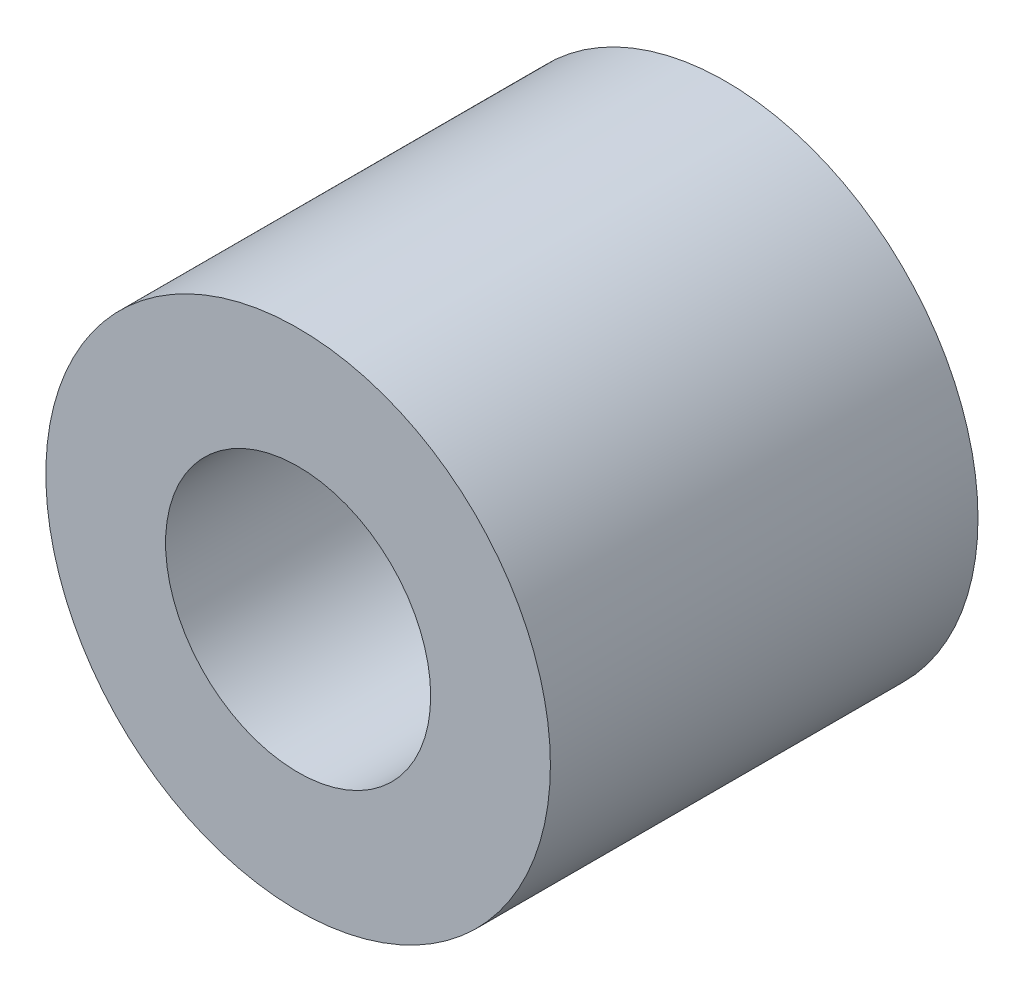
ISO-10303-21;
HEADER;
FILE_DESCRIPTION(('STEP AP214'),'2;1');
FILE_NAME('part.step','',(''),(''),'','','');
FILE_SCHEMA(('AUTOMOTIVE_DESIGN { 1 0 10303 214 1 1 1 1 }'));
ENDSEC;
DATA;
#1=APPLICATION_CONTEXT('core data for automotive mechanical design processes');
#2=APPLICATION_PROTOCOL_DEFINITION('international standard','automotive_design',2000,#1);
#3=PRODUCT_CONTEXT('',#1,'mechanical');
#4=PRODUCT('Part','Part','',(#3));
#5=PRODUCT_RELATED_PRODUCT_CATEGORY('part','',(#4));
#6=PRODUCT_DEFINITION_FORMATION('','',#4);
#7=PRODUCT_DEFINITION_CONTEXT('part definition',#1,'design');
#8=PRODUCT_DEFINITION('design','',#6,#7);
#9=PRODUCT_DEFINITION_SHAPE('','',#8);
#10=(LENGTH_UNIT() NAMED_UNIT(*) SI_UNIT(.MILLI.,.METRE.));
#11=(NAMED_UNIT(*) PLANE_ANGLE_UNIT() SI_UNIT($,.RADIAN.));
#12=(NAMED_UNIT(*) SI_UNIT($,.STERADIAN.) SOLID_ANGLE_UNIT());
#13=UNCERTAINTY_MEASURE_WITH_UNIT(LENGTH_MEASURE(1.E-05),#10,'distance_accuracy_value','');
#14=(GEOMETRIC_REPRESENTATION_CONTEXT(3) GLOBAL_UNCERTAINTY_ASSIGNED_CONTEXT((#13)) GLOBAL_UNIT_ASSIGNED_CONTEXT((#10,
#11,#12)) REPRESENTATION_CONTEXT('',''));
#15=CARTESIAN_POINT('',(0.,0.,0.));
#16=DIRECTION('',(0.,0.,1.));
#17=DIRECTION('',(1.,0.,0.));
#18=AXIS2_PLACEMENT_3D('',#15,#16,#17);
#19=CARTESIAN_POINT('',(0.,0.,5.));
#20=DIRECTION('',(0.,0.,-1.));
#21=DIRECTION('',(-1.,0.,0.));
#22=AXIS2_PLACEMENT_3D('',#19,#20,#21);
#23=CYLINDRICAL_SURFACE('',#22,2.95);
#24=CARTESIAN_POINT('',(0.,0.,5.));
#25=DIRECTION('',(0.,0.,1.));
#26=DIRECTION('',(1.,0.,0.));
#27=AXIS2_PLACEMENT_3D('',#24,#25,#26);
#28=CIRCLE('',#27,2.95);
#29=CARTESIAN_POINT('',(2.95,0.,5.));
#30=VERTEX_POINT('',#29);
#31=EDGE_CURVE('E10',#30,#30,#28,.T.);
#32=ORIENTED_EDGE('',*,*,#31,.F.);
#33=EDGE_LOOP('',(#32));
#34=FACE_BOUND('',#33,.T.);
#35=CARTESIAN_POINT('',(0.,0.,0.));
#36=DIRECTION('',(0.,0.,1.));
#37=DIRECTION('',(1.,0.,0.));
#38=AXIS2_PLACEMENT_3D('',#35,#36,#37);
#39=CIRCLE('',#38,2.95);
#40=CARTESIAN_POINT('',(2.95,0.,0.));
#41=VERTEX_POINT('',#40);
#42=EDGE_CURVE('E33',#41,#41,#39,.T.);
#43=ORIENTED_EDGE('',*,*,#42,.T.);
#44=EDGE_LOOP('',(#43));
#45=FACE_BOUND('',#44,.T.);
#46=ADVANCED_FACE('F30',(#34,#45),#23,.T.);
#47=CARTESIAN_POINT('',(0.,0.,5.));
#48=DIRECTION('',(0.,0.,1.));
#49=DIRECTION('',(1.,0.,0.));
#50=AXIS2_PLACEMENT_3D('',#47,#48,#49);
#51=PLANE('',#50);
#52=CARTESIAN_POINT('',(0.,0.,5.));
#53=DIRECTION('',(0.,0.,1.));
#54=DIRECTION('',(1.,0.,0.));
#55=AXIS2_PLACEMENT_3D('',#52,#53,#54);
#56=CIRCLE('',#55,1.55);
#57=CARTESIAN_POINT('',(1.55,0.,5.));
#58=VERTEX_POINT('',#57);
#59=EDGE_CURVE('E42',#58,#58,#56,.T.);
#60=ORIENTED_EDGE('',*,*,#59,.F.);
#61=EDGE_LOOP('',(#60));
#62=FACE_BOUND('',#61,.T.);
#63=ORIENTED_EDGE('',*,*,#31,.T.);
#64=EDGE_LOOP('',(#63));
#65=FACE_BOUND('',#64,.T.);
#66=ADVANCED_FACE('F57',(#62,#65),#51,.T.);
#67=CARTESIAN_POINT('',(0.,0.,0.));
#68=DIRECTION('',(0.,0.,1.));
#69=DIRECTION('',(1.,0.,0.));
#70=AXIS2_PLACEMENT_3D('',#67,#68,#69);
#71=PLANE('',#70);
#72=CARTESIAN_POINT('',(0.,0.,0.));
#73=DIRECTION('',(0.,0.,1.));
#74=DIRECTION('',(1.,0.,0.));
#75=AXIS2_PLACEMENT_3D('',#72,#73,#74);
#76=CIRCLE('',#75,1.55);
#77=CARTESIAN_POINT('',(1.55,0.,0.));
#78=VERTEX_POINT('',#77);
#79=EDGE_CURVE('E40',#78,#78,#76,.T.);
#80=ORIENTED_EDGE('',*,*,#79,.T.);
#81=EDGE_LOOP('',(#80));
#82=FACE_BOUND('',#81,.T.);
#83=ORIENTED_EDGE('',*,*,#42,.F.);
#84=EDGE_LOOP('',(#83));
#85=FACE_BOUND('',#84,.T.);
#86=ADVANCED_FACE('F48',(#82,#85),#71,.F.);
#87=CARTESIAN_POINT('',(0.,0.,0.));
#88=DIRECTION('',(0.,0.,1.));
#89=DIRECTION('',(1.,0.,0.));
#90=AXIS2_PLACEMENT_3D('',#87,#88,#89);
#91=CYLINDRICAL_SURFACE('',#90,1.55);
#92=ORIENTED_EDGE('',*,*,#79,.F.);
#93=EDGE_LOOP('',(#92));
#94=FACE_BOUND('',#93,.T.);
#95=ORIENTED_EDGE('',*,*,#59,.T.);
#96=EDGE_LOOP('',(#95));
#97=FACE_BOUND('',#96,.T.);
#98=ADVANCED_FACE('F51',(#94,#97),#91,.F.);
#99=CLOSED_SHELL('',(#46,#66,#86,#98));
#100=MANIFOLD_SOLID_BREP('B2',#99);
#101=ADVANCED_BREP_SHAPE_REPRESENTATION('',(#18,#100),#14);
#102=SHAPE_DEFINITION_REPRESENTATION(#9,#101);
ENDSEC;
END-ISO-10303-21;
